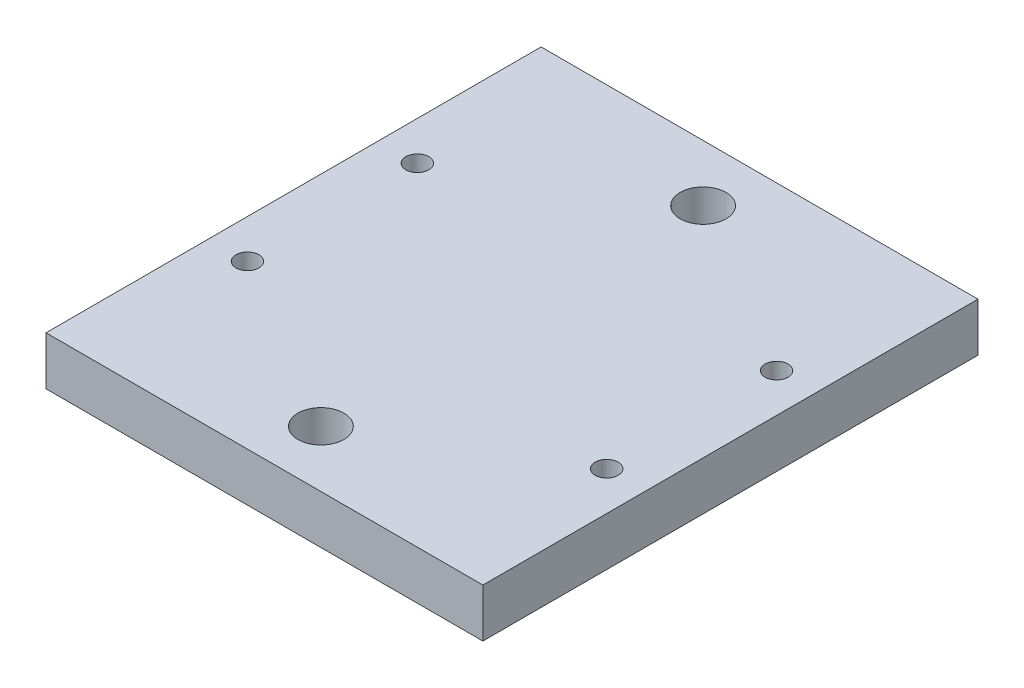
ISO-10303-21;
HEADER;
FILE_DESCRIPTION(('STEP AP214'),'2;1');
FILE_NAME('part.step','',(''),(''),'','','');
FILE_SCHEMA(('AUTOMOTIVE_DESIGN { 1 0 10303 214 1 1 1 1 }'));
ENDSEC;
DATA;
#1=APPLICATION_CONTEXT('core data for automotive mechanical design processes');
#2=APPLICATION_PROTOCOL_DEFINITION('international standard','automotive_design',2000,#1);
#3=PRODUCT_CONTEXT('',#1,'mechanical');
#4=PRODUCT('Part','Part','',(#3));
#5=PRODUCT_RELATED_PRODUCT_CATEGORY('part','',(#4));
#6=PRODUCT_DEFINITION_FORMATION('','',#4);
#7=PRODUCT_DEFINITION_CONTEXT('part definition',#1,'design');
#8=PRODUCT_DEFINITION('design','',#6,#7);
#9=PRODUCT_DEFINITION_SHAPE('','',#8);
#10=(LENGTH_UNIT() NAMED_UNIT(*) SI_UNIT(.MILLI.,.METRE.));
#11=(NAMED_UNIT(*) PLANE_ANGLE_UNIT() SI_UNIT($,.RADIAN.));
#12=(NAMED_UNIT(*) SI_UNIT($,.STERADIAN.) SOLID_ANGLE_UNIT());
#13=UNCERTAINTY_MEASURE_WITH_UNIT(LENGTH_MEASURE(1.E-05),#10,'distance_accuracy_value','');
#14=(GEOMETRIC_REPRESENTATION_CONTEXT(3) GLOBAL_UNCERTAINTY_ASSIGNED_CONTEXT((#13)) GLOBAL_UNIT_ASSIGNED_CONTEXT((#10,
#11,#12)) REPRESENTATION_CONTEXT('',''));
#15=CARTESIAN_POINT('',(0.,0.,0.));
#16=DIRECTION('',(0.,0.,1.));
#17=DIRECTION('',(1.,0.,0.));
#18=AXIS2_PLACEMENT_3D('',#15,#16,#17);
#19=CARTESIAN_POINT('',(0.,6.35,0.));
#20=DIRECTION('',(0.,0.,-1.));
#21=DIRECTION('',(-1.,0.,0.));
#22=AXIS2_PLACEMENT_3D('',#19,#20,#21);
#23=PLANE('',#22);
#24=DIRECTION('',(1.,0.,0.));
#25=VECTOR('',#24,1.);
#26=CARTESIAN_POINT('',(0.,0.,0.));
#27=LINE('',#26,#25);
#28=CARTESIAN_POINT('',(0.,0.,0.));
#29=VERTEX_POINT('',#28);
#30=CARTESIAN_POINT('',(57.15,0.,0.));
#31=VERTEX_POINT('',#30);
#32=EDGE_CURVE('E120',#29,#31,#27,.T.);
#33=ORIENTED_EDGE('',*,*,#32,.T.);
#34=DIRECTION('',(0.,-1.,0.));
#35=VECTOR('',#34,1.);
#36=CARTESIAN_POINT('',(57.15,6.35,0.));
#37=LINE('',#36,#35);
#38=CARTESIAN_POINT('',(57.15,6.35,0.));
#39=VERTEX_POINT('',#38);
#40=EDGE_CURVE('E11',#39,#31,#37,.T.);
#41=ORIENTED_EDGE('',*,*,#40,.F.);
#42=DIRECTION('',(1.,0.,0.));
#43=VECTOR('',#42,1.);
#44=CARTESIAN_POINT('',(0.,6.35,0.));
#45=LINE('',#44,#43);
#46=CARTESIAN_POINT('',(0.,6.35,0.));
#47=VERTEX_POINT('',#46);
#48=EDGE_CURVE('E88',#47,#39,#45,.T.);
#49=ORIENTED_EDGE('',*,*,#48,.F.);
#50=DIRECTION('',(0.,-1.,0.));
#51=VECTOR('',#50,1.);
#52=CARTESIAN_POINT('',(0.,6.35,0.));
#53=LINE('',#52,#51);
#54=EDGE_CURVE('E55',#47,#29,#53,.T.);
#55=ORIENTED_EDGE('',*,*,#54,.T.);
#56=EDGE_LOOP('',(#33,#41,#49,#55));
#57=FACE_BOUND('',#56,.T.);
#58=ADVANCED_FACE('F38',(#57),#23,.F.);
#59=CARTESIAN_POINT('',(57.15,6.35,0.));
#60=DIRECTION('',(-1.,0.,0.));
#61=DIRECTION('',(0.,0.,1.));
#62=AXIS2_PLACEMENT_3D('',#59,#60,#61);
#63=PLANE('',#62);
#64=DIRECTION('',(0.,0.,-1.));
#65=VECTOR('',#64,1.);
#66=CARTESIAN_POINT('',(57.15,0.,0.));
#67=LINE('',#66,#65);
#68=CARTESIAN_POINT('',(57.15,0.,-64.77));
#69=VERTEX_POINT('',#68);
#70=EDGE_CURVE('E93',#31,#69,#67,.T.);
#71=ORIENTED_EDGE('',*,*,#70,.T.);
#72=DIRECTION('',(0.,-1.,0.));
#73=VECTOR('',#72,1.);
#74=CARTESIAN_POINT('',(57.15,6.35,-64.77));
#75=LINE('',#74,#73);
#76=CARTESIAN_POINT('',(57.15,6.35,-64.77));
#77=VERTEX_POINT('',#76);
#78=EDGE_CURVE('E47',#77,#69,#75,.T.);
#79=ORIENTED_EDGE('',*,*,#78,.F.);
#80=DIRECTION('',(0.,0.,-1.));
#81=VECTOR('',#80,1.);
#82=CARTESIAN_POINT('',(57.15,6.35,0.));
#83=LINE('',#82,#81);
#84=EDGE_CURVE('E80',#39,#77,#83,.T.);
#85=ORIENTED_EDGE('',*,*,#84,.F.);
#86=ORIENTED_EDGE('',*,*,#40,.T.);
#87=EDGE_LOOP('',(#71,#79,#85,#86));
#88=FACE_BOUND('',#87,.T.);
#89=ADVANCED_FACE('F92',(#88),#63,.F.);
#90=CARTESIAN_POINT('',(0.,6.35,-64.77));
#91=DIRECTION('',(0.,0.,-1.));
#92=DIRECTION('',(-1.,0.,0.));
#93=AXIS2_PLACEMENT_3D('',#90,#91,#92);
#94=PLANE('',#93);
#95=DIRECTION('',(1.,0.,0.));
#96=VECTOR('',#95,1.);
#97=CARTESIAN_POINT('',(0.,0.,-64.77));
#98=LINE('',#97,#96);
#99=CARTESIAN_POINT('',(0.,0.,-64.77));
#100=VERTEX_POINT('',#99);
#101=EDGE_CURVE('E123',#100,#69,#98,.T.);
#102=ORIENTED_EDGE('',*,*,#101,.F.);
#103=DIRECTION('',(0.,-1.,0.));
#104=VECTOR('',#103,1.);
#105=CARTESIAN_POINT('',(0.,6.35,-64.77));
#106=LINE('',#105,#104);
#107=CARTESIAN_POINT('',(0.,6.35,-64.77));
#108=VERTEX_POINT('',#107);
#109=EDGE_CURVE('E69',#108,#100,#106,.T.);
#110=ORIENTED_EDGE('',*,*,#109,.F.);
#111=DIRECTION('',(1.,0.,0.));
#112=VECTOR('',#111,1.);
#113=CARTESIAN_POINT('',(0.,6.35,-64.77));
#114=LINE('',#113,#112);
#115=EDGE_CURVE('E87',#108,#77,#114,.T.);
#116=ORIENTED_EDGE('',*,*,#115,.T.);
#117=ORIENTED_EDGE('',*,*,#78,.T.);
#118=EDGE_LOOP('',(#102,#110,#116,#117));
#119=FACE_BOUND('',#118,.T.);
#120=ADVANCED_FACE('F96',(#119),#94,.T.);
#121=CARTESIAN_POINT('',(28.575,6.35,-57.385));
#122=DIRECTION('',(0.,-1.,0.));
#123=DIRECTION('',(0.,0.,-1.));
#124=AXIS2_PLACEMENT_3D('',#121,#122,#123);
#125=CYLINDRICAL_SURFACE('',#124,3.);
#126=CARTESIAN_POINT('',(28.575,6.35,-57.385));
#127=DIRECTION('',(0.,1.,0.));
#128=DIRECTION('',(0.,0.,1.));
#129=AXIS2_PLACEMENT_3D('',#126,#127,#128);
#130=CIRCLE('',#129,3.);
#131=CARTESIAN_POINT('',(28.575,6.35,-54.385));
#132=VERTEX_POINT('',#131);
#133=EDGE_CURVE('E148',#132,#132,#130,.T.);
#134=ORIENTED_EDGE('',*,*,#133,.T.);
#135=EDGE_LOOP('',(#134));
#136=FACE_BOUND('',#135,.T.);
#137=CARTESIAN_POINT('',(28.575,0.,-57.385));
#138=DIRECTION('',(0.,1.,0.));
#139=DIRECTION('',(0.,0.,1.));
#140=AXIS2_PLACEMENT_3D('',#137,#138,#139);
#141=CIRCLE('',#140,3.);
#142=CARTESIAN_POINT('',(28.575,0.,-54.385));
#143=VERTEX_POINT('',#142);
#144=EDGE_CURVE('E117',#143,#143,#141,.T.);
#145=ORIENTED_EDGE('',*,*,#144,.F.);
#146=EDGE_LOOP('',(#145));
#147=FACE_BOUND('',#146,.T.);
#148=ADVANCED_FACE('F152',(#136,#147),#125,.F.);
#149=CARTESIAN_POINT('',(28.575,6.35,-7.385));
#150=DIRECTION('',(0.,-1.,0.));
#151=DIRECTION('',(0.,0.,-1.));
#152=AXIS2_PLACEMENT_3D('',#149,#150,#151);
#153=CYLINDRICAL_SURFACE('',#152,3.);
#154=CARTESIAN_POINT('',(28.575,6.35,-7.385));
#155=DIRECTION('',(0.,1.,0.));
#156=DIRECTION('',(0.,0.,1.));
#157=AXIS2_PLACEMENT_3D('',#154,#155,#156);
#158=CIRCLE('',#157,3.);
#159=CARTESIAN_POINT('',(28.575,6.35,-4.38499999999999));
#160=VERTEX_POINT('',#159);
#161=EDGE_CURVE('E145',#160,#160,#158,.T.);
#162=ORIENTED_EDGE('',*,*,#161,.T.);
#163=EDGE_LOOP('',(#162));
#164=FACE_BOUND('',#163,.T.);
#165=CARTESIAN_POINT('',(28.575,0.,-7.385));
#166=DIRECTION('',(0.,1.,0.));
#167=DIRECTION('',(0.,0.,1.));
#168=AXIS2_PLACEMENT_3D('',#165,#166,#167);
#169=CIRCLE('',#168,3.);
#170=CARTESIAN_POINT('',(28.575,0.,-4.38499999999999));
#171=VERTEX_POINT('',#170);
#172=EDGE_CURVE('E114',#171,#171,#169,.T.);
#173=ORIENTED_EDGE('',*,*,#172,.F.);
#174=EDGE_LOOP('',(#173));
#175=FACE_BOUND('',#174,.T.);
#176=ADVANCED_FACE('F178',(#164,#175),#153,.F.);
#177=CARTESIAN_POINT('',(52.07,6.35,-43.4975));
#178=DIRECTION('',(0.,-1.,0.));
#179=DIRECTION('',(0.,0.,-1.));
#180=AXIS2_PLACEMENT_3D('',#177,#178,#179);
#181=CYLINDRICAL_SURFACE('',#180,1.5);
#182=CARTESIAN_POINT('',(52.07,6.35,-43.4975));
#183=DIRECTION('',(0.,1.,0.));
#184=DIRECTION('',(0.,0.,1.));
#185=AXIS2_PLACEMENT_3D('',#182,#183,#184);
#186=CIRCLE('',#185,1.5);
#187=CARTESIAN_POINT('',(52.07,6.35,-41.9975));
#188=VERTEX_POINT('',#187);
#189=EDGE_CURVE('E142',#188,#188,#186,.T.);
#190=ORIENTED_EDGE('',*,*,#189,.T.);
#191=EDGE_LOOP('',(#190));
#192=FACE_BOUND('',#191,.T.);
#193=CARTESIAN_POINT('',(52.07,0.,-43.4975));
#194=DIRECTION('',(0.,1.,0.));
#195=DIRECTION('',(0.,0.,1.));
#196=AXIS2_PLACEMENT_3D('',#193,#194,#195);
#197=CIRCLE('',#196,1.5);
#198=CARTESIAN_POINT('',(52.07,0.,-41.9975));
#199=VERTEX_POINT('',#198);
#200=EDGE_CURVE('E111',#199,#199,#197,.T.);
#201=ORIENTED_EDGE('',*,*,#200,.F.);
#202=EDGE_LOOP('',(#201));
#203=FACE_BOUND('',#202,.T.);
#204=ADVANCED_FACE('F181',(#192,#203),#181,.F.);
#205=CARTESIAN_POINT('',(52.07,6.35,-21.2725));
#206=DIRECTION('',(0.,-1.,0.));
#207=DIRECTION('',(0.,0.,-1.));
#208=AXIS2_PLACEMENT_3D('',#205,#206,#207);
#209=CYLINDRICAL_SURFACE('',#208,1.5);
#210=CARTESIAN_POINT('',(52.07,6.35,-21.2725));
#211=DIRECTION('',(0.,1.,0.));
#212=DIRECTION('',(0.,0.,1.));
#213=AXIS2_PLACEMENT_3D('',#210,#211,#212);
#214=CIRCLE('',#213,1.5);
#215=CARTESIAN_POINT('',(52.07,6.35,-19.7725));
#216=VERTEX_POINT('',#215);
#217=EDGE_CURVE('E137',#216,#216,#214,.T.);
#218=ORIENTED_EDGE('',*,*,#217,.T.);
#219=EDGE_LOOP('',(#218));
#220=FACE_BOUND('',#219,.T.);
#221=CARTESIAN_POINT('',(52.07,0.,-21.2725));
#222=DIRECTION('',(0.,1.,0.));
#223=DIRECTION('',(0.,0.,1.));
#224=AXIS2_PLACEMENT_3D('',#221,#222,#223);
#225=CIRCLE('',#224,1.5);
#226=CARTESIAN_POINT('',(52.07,0.,-19.7725));
#227=VERTEX_POINT('',#226);
#228=EDGE_CURVE('E108',#227,#227,#225,.T.);
#229=ORIENTED_EDGE('',*,*,#228,.F.);
#230=EDGE_LOOP('',(#229));
#231=FACE_BOUND('',#230,.T.);
#232=ADVANCED_FACE('F185',(#220,#231),#209,.F.);
#233=CARTESIAN_POINT('',(5.07999999999997,6.35,-43.4975));
#234=DIRECTION('',(0.,-1.,0.));
#235=DIRECTION('',(0.,0.,-1.));
#236=AXIS2_PLACEMENT_3D('',#233,#234,#235);
#237=CYLINDRICAL_SURFACE('',#236,1.5);
#238=CARTESIAN_POINT('',(5.07999999999997,6.35,-43.4975));
#239=DIRECTION('',(0.,1.,0.));
#240=DIRECTION('',(0.,0.,1.));
#241=AXIS2_PLACEMENT_3D('',#238,#239,#240);
#242=CIRCLE('',#241,1.5);
#243=CARTESIAN_POINT('',(5.07999999999997,6.35,-41.9975));
#244=VERTEX_POINT('',#243);
#245=EDGE_CURVE('E132',#244,#244,#242,.T.);
#246=ORIENTED_EDGE('',*,*,#245,.T.);
#247=EDGE_LOOP('',(#246));
#248=FACE_BOUND('',#247,.T.);
#249=CARTESIAN_POINT('',(5.07999999999997,0.,-43.4975));
#250=DIRECTION('',(0.,1.,0.));
#251=DIRECTION('',(0.,0.,1.));
#252=AXIS2_PLACEMENT_3D('',#249,#250,#251);
#253=CIRCLE('',#252,1.5);
#254=CARTESIAN_POINT('',(5.07999999999997,0.,-41.9975));
#255=VERTEX_POINT('',#254);
#256=EDGE_CURVE('E105',#255,#255,#253,.T.);
#257=ORIENTED_EDGE('',*,*,#256,.F.);
#258=EDGE_LOOP('',(#257));
#259=FACE_BOUND('',#258,.T.);
#260=ADVANCED_FACE('F188',(#248,#259),#237,.F.);
#261=CARTESIAN_POINT('',(5.07999999999997,6.35,-21.2725));
#262=DIRECTION('',(0.,-1.,0.));
#263=DIRECTION('',(0.,0.,-1.));
#264=AXIS2_PLACEMENT_3D('',#261,#262,#263);
#265=CYLINDRICAL_SURFACE('',#264,1.5);
#266=CARTESIAN_POINT('',(5.07999999999997,6.35,-21.2725));
#267=DIRECTION('',(0.,1.,0.));
#268=DIRECTION('',(0.,0.,1.));
#269=AXIS2_PLACEMENT_3D('',#266,#267,#268);
#270=CIRCLE('',#269,1.5);
#271=CARTESIAN_POINT('',(5.07999999999997,6.35,-19.7725));
#272=VERTEX_POINT('',#271);
#273=EDGE_CURVE('E128',#272,#272,#270,.T.);
#274=ORIENTED_EDGE('',*,*,#273,.T.);
#275=EDGE_LOOP('',(#274));
#276=FACE_BOUND('',#275,.T.);
#277=CARTESIAN_POINT('',(5.07999999999997,0.,-21.2725));
#278=DIRECTION('',(0.,1.,0.));
#279=DIRECTION('',(0.,0.,1.));
#280=AXIS2_PLACEMENT_3D('',#277,#278,#279);
#281=CIRCLE('',#280,1.5);
#282=CARTESIAN_POINT('',(5.07999999999997,0.,-19.7725));
#283=VERTEX_POINT('',#282);
#284=EDGE_CURVE('E102',#283,#283,#281,.T.);
#285=ORIENTED_EDGE('',*,*,#284,.F.);
#286=EDGE_LOOP('',(#285));
#287=FACE_BOUND('',#286,.T.);
#288=ADVANCED_FACE('F40',(#276,#287),#265,.F.);
#289=CARTESIAN_POINT('',(0.,6.35,0.));
#290=DIRECTION('',(-1.,0.,0.));
#291=DIRECTION('',(0.,0.,1.));
#292=AXIS2_PLACEMENT_3D('',#289,#290,#291);
#293=PLANE('',#292);
#294=DIRECTION('',(0.,0.,-1.));
#295=VECTOR('',#294,1.);
#296=CARTESIAN_POINT('',(0.,0.,0.));
#297=LINE('',#296,#295);
#298=EDGE_CURVE('E125',#29,#100,#297,.T.);
#299=ORIENTED_EDGE('',*,*,#298,.F.);
#300=ORIENTED_EDGE('',*,*,#54,.F.);
#301=DIRECTION('',(0.,0.,-1.));
#302=VECTOR('',#301,1.);
#303=CARTESIAN_POINT('',(0.,6.35,0.));
#304=LINE('',#303,#302);
#305=EDGE_CURVE('E97',#47,#108,#304,.T.);
#306=ORIENTED_EDGE('',*,*,#305,.T.);
#307=ORIENTED_EDGE('',*,*,#109,.T.);
#308=EDGE_LOOP('',(#299,#300,#306,#307));
#309=FACE_BOUND('',#308,.T.);
#310=ADVANCED_FACE('F157',(#309),#293,.T.);
#311=CARTESIAN_POINT('',(0.,6.35,0.));
#312=DIRECTION('',(0.,1.,0.));
#313=DIRECTION('',(0.,0.,1.));
#314=AXIS2_PLACEMENT_3D('',#311,#312,#313);
#315=PLANE('',#314);
#316=ORIENTED_EDGE('',*,*,#273,.F.);
#317=EDGE_LOOP('',(#316));
#318=FACE_BOUND('',#317,.T.);
#319=ORIENTED_EDGE('',*,*,#245,.F.);
#320=EDGE_LOOP('',(#319));
#321=FACE_BOUND('',#320,.T.);
#322=ORIENTED_EDGE('',*,*,#217,.F.);
#323=EDGE_LOOP('',(#322));
#324=FACE_BOUND('',#323,.T.);
#325=ORIENTED_EDGE('',*,*,#189,.F.);
#326=EDGE_LOOP('',(#325));
#327=FACE_BOUND('',#326,.T.);
#328=ORIENTED_EDGE('',*,*,#161,.F.);
#329=EDGE_LOOP('',(#328));
#330=FACE_BOUND('',#329,.T.);
#331=ORIENTED_EDGE('',*,*,#133,.F.);
#332=EDGE_LOOP('',(#331));
#333=FACE_BOUND('',#332,.T.);
#334=ORIENTED_EDGE('',*,*,#48,.T.);
#335=ORIENTED_EDGE('',*,*,#84,.T.);
#336=ORIENTED_EDGE('',*,*,#115,.F.);
#337=ORIENTED_EDGE('',*,*,#305,.F.);
#338=EDGE_LOOP('',(#334,#335,#336,#337));
#339=FACE_BOUND('',#338,.T.);
#340=ADVANCED_FACE('F84',(#318,#321,#324,#327,#330,#333,#339),#315,.T.);
#341=CARTESIAN_POINT('',(0.,0.,0.));
#342=DIRECTION('',(0.,1.,0.));
#343=DIRECTION('',(0.,0.,1.));
#344=AXIS2_PLACEMENT_3D('',#341,#342,#343);
#345=PLANE('',#344);
#346=ORIENTED_EDGE('',*,*,#284,.T.);
#347=EDGE_LOOP('',(#346));
#348=FACE_BOUND('',#347,.T.);
#349=ORIENTED_EDGE('',*,*,#256,.T.);
#350=EDGE_LOOP('',(#349));
#351=FACE_BOUND('',#350,.T.);
#352=ORIENTED_EDGE('',*,*,#228,.T.);
#353=EDGE_LOOP('',(#352));
#354=FACE_BOUND('',#353,.T.);
#355=ORIENTED_EDGE('',*,*,#200,.T.);
#356=EDGE_LOOP('',(#355));
#357=FACE_BOUND('',#356,.T.);
#358=ORIENTED_EDGE('',*,*,#172,.T.);
#359=EDGE_LOOP('',(#358));
#360=FACE_BOUND('',#359,.T.);
#361=ORIENTED_EDGE('',*,*,#144,.T.);
#362=EDGE_LOOP('',(#361));
#363=FACE_BOUND('',#362,.T.);
#364=ORIENTED_EDGE('',*,*,#32,.F.);
#365=ORIENTED_EDGE('',*,*,#298,.T.);
#366=ORIENTED_EDGE('',*,*,#101,.T.);
#367=ORIENTED_EDGE('',*,*,#70,.F.);
#368=EDGE_LOOP('',(#364,#365,#366,#367));
#369=FACE_BOUND('',#368,.T.);
#370=ADVANCED_FACE('F156',(#348,#351,#354,#357,#360,#363,#369),#345,.F.);
#371=CLOSED_SHELL('',(#58,#89,#120,#148,#176,#204,#232,#260,#288,#310,#340,#370));
#372=MANIFOLD_SOLID_BREP('B2',#371);
#373=ADVANCED_BREP_SHAPE_REPRESENTATION('',(#18,#372),#14);
#374=SHAPE_DEFINITION_REPRESENTATION(#9,#373);
ENDSEC;
END-ISO-10303-21;
